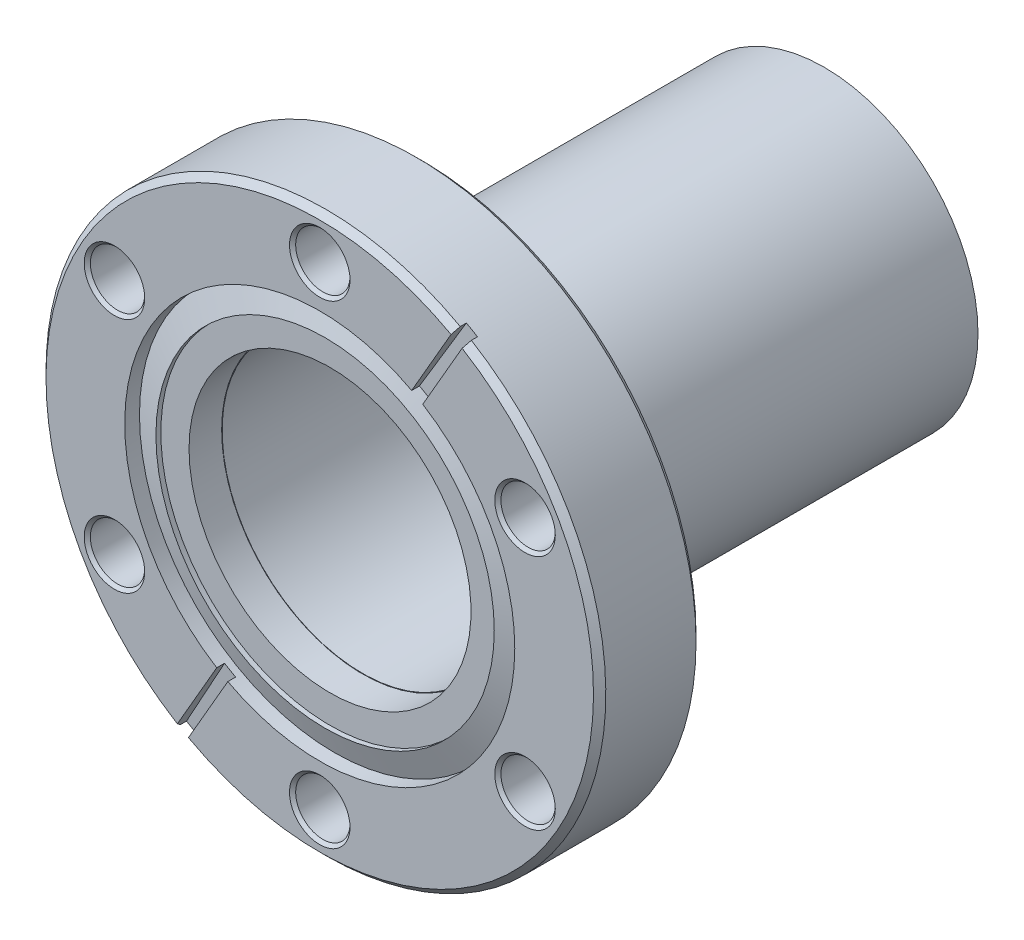
ISO-10303-21;
HEADER;
FILE_DESCRIPTION(('STEP AP214'),'2;1');
FILE_NAME('part.step','',(''),(''),'','','');
FILE_SCHEMA(('AUTOMOTIVE_DESIGN { 1 0 10303 214 1 1 1 1 }'));
ENDSEC;
DATA;
#1=APPLICATION_CONTEXT('core data for automotive mechanical design processes');
#2=APPLICATION_PROTOCOL_DEFINITION('international standard','automotive_design',2000,#1);
#3=PRODUCT_CONTEXT('',#1,'mechanical');
#4=PRODUCT('Part','Part','',(#3));
#5=PRODUCT_RELATED_PRODUCT_CATEGORY('part','',(#4));
#6=PRODUCT_DEFINITION_FORMATION('','',#4);
#7=PRODUCT_DEFINITION_CONTEXT('part definition',#1,'design');
#8=PRODUCT_DEFINITION('design','',#6,#7);
#9=PRODUCT_DEFINITION_SHAPE('','',#8);
#10=(LENGTH_UNIT() NAMED_UNIT(*) SI_UNIT(.MILLI.,.METRE.));
#11=(NAMED_UNIT(*) PLANE_ANGLE_UNIT() SI_UNIT($,.RADIAN.));
#12=(NAMED_UNIT(*) SI_UNIT($,.STERADIAN.) SOLID_ANGLE_UNIT());
#13=UNCERTAINTY_MEASURE_WITH_UNIT(LENGTH_MEASURE(1.E-05),#10,'distance_accuracy_value','');
#14=(GEOMETRIC_REPRESENTATION_CONTEXT(3) GLOBAL_UNCERTAINTY_ASSIGNED_CONTEXT((#13)) GLOBAL_UNIT_ASSIGNED_CONTEXT((#10,
#11,#12)) REPRESENTATION_CONTEXT('',''));
#15=CARTESIAN_POINT('',(0.,0.,0.));
#16=DIRECTION('',(0.,0.,1.));
#17=DIRECTION('',(1.,0.,0.));
#18=AXIS2_PLACEMENT_3D('',#15,#16,#17);
#19=CARTESIAN_POINT('',(0.,0.,-62.484));
#20=DIRECTION('',(0.,0.,1.));
#21=DIRECTION('',(1.,0.,0.));
#22=AXIS2_PLACEMENT_3D('',#19,#20,#21);
#23=CYLINDRICAL_SURFACE('',#22,17.399);
#24=CARTESIAN_POINT('',(0.,0.,-5.30859999999999));
#25=DIRECTION('',(0.,0.,1.));
#26=DIRECTION('',(1.,0.,0.));
#27=AXIS2_PLACEMENT_3D('',#24,#25,#26);
#28=CIRCLE('',#27,17.399);
#29=CARTESIAN_POINT('',(17.399,0.,-5.30859999999999));
#30=VERTEX_POINT('',#29);
#31=EDGE_CURVE('P0_E26',#30,#30,#28,.F.);
#32=ORIENTED_EDGE('',*,*,#31,.F.);
#33=EDGE_LOOP('',(#32));
#34=FACE_BOUND('',#33,.T.);
#35=CARTESIAN_POINT('',(0.,0.,-62.484));
#36=DIRECTION('',(0.,0.,1.));
#37=DIRECTION('',(1.,0.,0.));
#38=AXIS2_PLACEMENT_3D('',#35,#36,#37);
#39=CIRCLE('',#38,17.399);
#40=CARTESIAN_POINT('',(17.399,0.,-62.484));
#41=VERTEX_POINT('',#40);
#42=EDGE_CURVE('P0_E17',#41,#41,#39,.F.);
#43=ORIENTED_EDGE('',*,*,#42,.T.);
#44=EDGE_LOOP('',(#43));
#45=FACE_BOUND('',#44,.T.);
#46=ADVANCED_FACE('P0_F14',(#34,#45),#23,.F.);
#47=CARTESIAN_POINT('',(0.,0.,-62.484));
#48=DIRECTION('',(0.,0.,1.));
#49=DIRECTION('',(1.,0.,0.));
#50=AXIS2_PLACEMENT_3D('',#47,#48,#49);
#51=PLANE('',#50);
#52=CARTESIAN_POINT('',(0.,0.,-62.484));
#53=DIRECTION('',(0.,0.,1.));
#54=DIRECTION('',(1.,0.,0.));
#55=AXIS2_PLACEMENT_3D('',#52,#53,#54);
#56=CIRCLE('',#55,19.05);
#57=CARTESIAN_POINT('',(19.05,0.,-62.484));
#58=VERTEX_POINT('',#57);
#59=EDGE_CURVE('P0_E21',#58,#58,#56,.T.);
#60=ORIENTED_EDGE('',*,*,#59,.F.);
#61=EDGE_LOOP('',(#60));
#62=FACE_BOUND('',#61,.T.);
#63=ORIENTED_EDGE('',*,*,#42,.F.);
#64=EDGE_LOOP('',(#63));
#65=FACE_BOUND('',#64,.T.);
#66=ADVANCED_FACE('P0_F35',(#62,#65),#51,.F.);
#67=CARTESIAN_POINT('',(0.,0.,-5.30859999999999));
#68=DIRECTION('',(0.,0.,1.));
#69=DIRECTION('',(1.,0.,0.));
#70=AXIS2_PLACEMENT_3D('',#67,#68,#69);
#71=PLANE('',#70);
#72=CARTESIAN_POINT('',(0.,0.,-5.30859999999999));
#73=DIRECTION('',(0.,0.,1.));
#74=DIRECTION('',(1.,0.,0.));
#75=AXIS2_PLACEMENT_3D('',#72,#73,#74);
#76=CIRCLE('',#75,19.05);
#77=CARTESIAN_POINT('',(19.05,0.,-5.30859999999999));
#78=VERTEX_POINT('',#77);
#79=EDGE_CURVE('P0_E10',#78,#78,#76,.F.);
#80=ORIENTED_EDGE('',*,*,#79,.F.);
#81=EDGE_LOOP('',(#80));
#82=FACE_BOUND('',#81,.T.);
#83=ORIENTED_EDGE('',*,*,#31,.T.);
#84=EDGE_LOOP('',(#83));
#85=FACE_BOUND('',#84,.T.);
#86=ADVANCED_FACE('P0_F37',(#82,#85),#71,.T.);
#87=CARTESIAN_POINT('',(0.,0.,-62.484));
#88=DIRECTION('',(0.,0.,1.));
#89=DIRECTION('',(1.,0.,0.));
#90=AXIS2_PLACEMENT_3D('',#87,#88,#89);
#91=CYLINDRICAL_SURFACE('',#90,19.05);
#92=ORIENTED_EDGE('',*,*,#79,.T.);
#93=EDGE_LOOP('',(#92));
#94=FACE_BOUND('',#93,.T.);
#95=ORIENTED_EDGE('',*,*,#59,.T.);
#96=EDGE_LOOP('',(#95));
#97=FACE_BOUND('',#96,.T.);
#98=ADVANCED_FACE('P0_F44',(#94,#97),#91,.T.);
#99=CLOSED_SHELL('',(#46,#66,#86,#98));
#100=MANIFOLD_SOLID_BREP('P0_B1',#99);
#101=CARTESIAN_POINT('',(0.,0.,-1.91651285463287));
#102=DIRECTION('',(0.,0.,1.));
#103=DIRECTION('',(1.,0.,0.));
#104=AXIS2_PLACEMENT_3D('',#101,#102,#103);
#105=CYLINDRICAL_SURFACE('',#104,20.955);
#106=CARTESIAN_POINT('',(0.,0.,-0.660399999999616));
#107=DIRECTION('',(0.,0.,-1.));
#108=DIRECTION('',(-1.,0.,0.));
#109=AXIS2_PLACEMENT_3D('',#106,#107,#108);
#110=CIRCLE('',#109,20.9550000000001);
#111=CARTESIAN_POINT('',(-20.9550000000001,0.,-0.660399999999616));
#112=VERTEX_POINT('',#111);
#113=EDGE_CURVE('P1_E128',#112,#112,#110,.T.);
#114=ORIENTED_EDGE('',*,*,#113,.F.);
#115=EDGE_LOOP('',(#114));
#116=FACE_BOUND('',#115,.T.);
#117=CARTESIAN_POINT('',(0.,0.,-1.27));
#118=DIRECTION('',(0.,0.,1.));
#119=DIRECTION('',(1.,0.,0.));
#120=AXIS2_PLACEMENT_3D('',#117,#118,#119);
#121=CIRCLE('',#120,20.955);
#122=CARTESIAN_POINT('',(20.955,0.,-1.27));
#123=VERTEX_POINT('',#122);
#124=EDGE_CURVE('P1_E130',#123,#123,#121,.T.);
#125=ORIENTED_EDGE('',*,*,#124,.F.);
#126=EDGE_LOOP('',(#125));
#127=FACE_BOUND('',#126,.T.);
#128=ADVANCED_FACE('P1_F16',(#116,#127),#105,.F.);
#129=CARTESIAN_POINT('',(-11.1362923357452,-20.8761241334518,-0.9398));
#130=DIRECTION('',(-0.0261679781214693,-0.0453242676377388,0.998629534754574));
#131=DIRECTION('',(0.,-0.998971622769016,-0.0453397938045331));
#132=AXIS2_PLACEMENT_3D('',#129,#130,#131);
#133=PLANE('',#132);
#134=DIRECTION('',(-0.499314767377303,-0.864838546066886,-0.0523359562429542));
#135=VECTOR('',#134,1.);
#136=CARTESIAN_POINT('',(-11.3837698890914,-21.3047678295779,-0.965739497986353));
#137=LINE('',#136,#135);
#138=CARTESIAN_POINT('',(-11.3837698890905,-21.3047678295783,-0.965739497986395));
#139=VERTEX_POINT('',#138);
#140=CARTESIAN_POINT('',(-16.6435487572592,-30.4149720658212,-1.51704615798751));
#141=VERTEX_POINT('',#140);
#142=EDGE_CURVE('P1_E116',#139,#141,#137,.T.);
#143=ORIENTED_EDGE('',*,*,#142,.F.);
#144=CARTESIAN_POINT('',(0.,0.,0.299507719817694));
#145=DIRECTION('',(-0.0261679781214693,-0.0453242676377388,0.998629534754574));
#146=DIRECTION('',(0.499314767377261,0.864838546066911,0.0523359562429414));
#147=AXIS2_PLACEMENT_3D('',#144,#145,#146);
#148=ELLIPSE('',#147,24.1885495665182,24.1554);
#149=CARTESIAN_POINT('',(-12.758585217599,-20.5110178295779,-0.965739497986381));
#150=VERTEX_POINT('',#149);
#151=EDGE_CURVE('P1_E204',#139,#150,#148,.F.);
#152=ORIENTED_EDGE('',*,*,#151,.T.);
#153=DIRECTION('',(-0.499314767377303,-0.864838546066886,-0.0523359562429542));
#154=VECTOR('',#153,1.);
#155=CARTESIAN_POINT('',(-12.758585217599,-20.5110178295779,-0.965739497986328));
#156=LINE('',#155,#154);
#157=CARTESIAN_POINT('',(-18.0183640857669,-29.6212220658215,-1.5170461579875));
#158=VERTEX_POINT('',#157);
#159=EDGE_CURVE('P1_E113',#150,#158,#156,.T.);
#160=ORIENTED_EDGE('',*,*,#159,.T.);
#161=CARTESIAN_POINT('',(0.,0.,0.299507719817694));
#162=DIRECTION('',(-0.0261679781214693,-0.0453242676377388,0.998629534754574));
#163=DIRECTION('',(-0.499314767377261,-0.864838546066911,-0.0523359562429414));
#164=AXIS2_PLACEMENT_3D('',#161,#162,#163);
#165=ELLIPSE('',#164,34.7185806080939,34.671);
#166=EDGE_CURVE('P1_E19',#158,#141,#165,.T.);
#167=ORIENTED_EDGE('',*,*,#166,.T.);
#168=EDGE_LOOP('',(#143,#152,#160,#167));
#169=FACE_BOUND('',#168,.T.);
#170=ADVANCED_FACE('P1_F377',(#169),#133,.T.);
#171=CARTESIAN_POINT('',(12.5111076642548,20.0823741334518,-0.9398));
#172=DIRECTION('',(-0.0261679781214693,-0.0453242676377388,-0.998629534754574));
#173=DIRECTION('',(0.,0.998971622769016,-0.0453397938045331));
#174=AXIS2_PLACEMENT_3D('',#171,#172,#173);
#175=PLANE('',#174);
#176=DIRECTION('',(0.499314767377303,0.864838546066886,-0.0523359562429542));
#177=VECTOR('',#176,1.);
#178=CARTESIAN_POINT('',(12.758585217599,20.5110178295779,-0.965739497986305));
#179=LINE('',#178,#177);
#180=CARTESIAN_POINT('',(12.758585217599,20.511017829578,-0.965739497986347));
#181=VERTEX_POINT('',#180);
#182=CARTESIAN_POINT('',(18.0183640857669,29.6212220658215,-1.51704615798747));
#183=VERTEX_POINT('',#182);
#184=EDGE_CURVE('P1_E124',#181,#183,#179,.T.);
#185=ORIENTED_EDGE('',*,*,#184,.T.);
#186=CARTESIAN_POINT('',(0.,0.,0.299507719817739));
#187=DIRECTION('',(-0.0261679781214693,-0.0453242676377388,-0.998629534754574));
#188=DIRECTION('',(0.499314767377261,0.864838546066911,-0.0523359562429414));
#189=AXIS2_PLACEMENT_3D('',#186,#187,#188);
#190=ELLIPSE('',#189,34.7185806080939,34.671);
#191=CARTESIAN_POINT('',(16.6435487572592,30.4149720658212,-1.51704615798747));
#192=VERTEX_POINT('',#191);
#193=EDGE_CURVE('P1_E417',#192,#183,#190,.T.);
#194=ORIENTED_EDGE('',*,*,#193,.F.);
#195=DIRECTION('',(0.499314767377303,0.864838546066886,-0.0523359562429542));
#196=VECTOR('',#195,1.);
#197=CARTESIAN_POINT('',(11.3837698890914,21.3047678295779,-0.965739497986329));
#198=LINE('',#197,#196);
#199=CARTESIAN_POINT('',(11.3837698890905,21.3047678295783,-0.96573949798636));
#200=VERTEX_POINT('',#199);
#201=EDGE_CURVE('P1_E90',#200,#192,#198,.T.);
#202=ORIENTED_EDGE('',*,*,#201,.F.);
#203=CARTESIAN_POINT('',(0.,0.,0.299507719817739));
#204=DIRECTION('',(-0.0261679781214693,-0.0453242676377388,-0.998629534754574));
#205=DIRECTION('',(-0.499314767377261,-0.864838546066911,0.0523359562429414));
#206=AXIS2_PLACEMENT_3D('',#203,#204,#205);
#207=ELLIPSE('',#206,24.1885495665182,24.1554);
#208=EDGE_CURVE('P1_E131',#181,#200,#207,.F.);
#209=ORIENTED_EDGE('',*,*,#208,.F.);
#210=EDGE_LOOP('',(#185,#194,#202,#209));
#211=FACE_BOUND('',#210,.T.);
#212=ADVANCED_FACE('P1_F374',(#211),#175,.F.);
#213=CARTESIAN_POINT('',(0.,0.,-1.82525033774552));
#214=DIRECTION('',(0.,0.,-1.));
#215=DIRECTION('',(-1.,0.,0.));
#216=AXIS2_PLACEMENT_3D('',#213,#214,#215);
#217=CONICAL_SURFACE('',#216,24.1553999999988,1.2217304763958);
#218=CARTESIAN_POINT('',(0.,0.,-1.82525033774552));
#219=DIRECTION('',(0.,0.,1.));
#220=DIRECTION('',(1.,0.,0.));
#221=AXIS2_PLACEMENT_3D('',#218,#219,#220);
#222=CIRCLE('',#221,24.1554);
#223=CARTESIAN_POINT('',(24.1554,0.,-1.82525033774552));
#224=VERTEX_POINT('',#223);
#225=EDGE_CURVE('P1_E195',#224,#224,#222,.T.);
#226=ORIENTED_EDGE('',*,*,#225,.T.);
#227=EDGE_LOOP('',(#226));
#228=FACE_BOUND('',#227,.T.);
#229=ORIENTED_EDGE('',*,*,#113,.T.);
#230=EDGE_LOOP('',(#229));
#231=FACE_BOUND('',#230,.T.);
#232=ADVANCED_FACE('P1_F370',(#228,#231),#217,.T.);
#233=CARTESIAN_POINT('',(0.,0.,-1.27));
#234=DIRECTION('',(0.,0.,1.));
#235=DIRECTION('',(1.,0.,0.));
#236=AXIS2_PLACEMENT_3D('',#233,#234,#235);
#237=PLANE('',#236);
#238=ORIENTED_EDGE('',*,*,#124,.T.);
#239=EDGE_LOOP('',(#238));
#240=FACE_BOUND('',#239,.T.);
#241=CARTESIAN_POINT('',(0.,0.,-1.27));
#242=DIRECTION('',(0.,0.,-1.));
#243=DIRECTION('',(-1.,0.,0.));
#244=AXIS2_PLACEMENT_3D('',#241,#242,#243);
#245=CIRCLE('',#244,17.4625);
#246=CARTESIAN_POINT('',(-17.4625,0.,-1.27));
#247=VERTEX_POINT('',#246);
#248=EDGE_CURVE('P1_E193',#247,#247,#245,.T.);
#249=ORIENTED_EDGE('',*,*,#248,.T.);
#250=EDGE_LOOP('',(#249));
#251=FACE_BOUND('',#250,.T.);
#252=ADVANCED_FACE('P1_F366',(#240,#251),#237,.T.);
#253=CARTESIAN_POINT('',(0.687407664253804,-0.396875,0.));
#254=DIRECTION('',(-0.866025403784429,0.500000000000017,0.));
#255=DIRECTION('',(-0.500000000000017,-0.866025403784429,0.));
#256=AXIS2_PLACEMENT_3D('',#253,#254,#255);
#257=PLANE('',#256);
#258=ORIENTED_EDGE('',*,*,#142,.T.);
#259=DIRECTION('',(0.,0.,1.));
#260=VECTOR('',#259,1.);
#261=CARTESIAN_POINT('',(-16.6435487572588,-30.4149720658206,0.));
#262=LINE('',#261,#260);
#263=CARTESIAN_POINT('',(-16.6435487572585,-30.41497206582,-0.762000000000726));
#264=VERTEX_POINT('',#263);
#265=EDGE_CURVE('P1_E119',#141,#264,#262,.T.);
#266=ORIENTED_EDGE('',*,*,#265,.T.);
#267=DIRECTION('',(0.353600767689951,0.612454495234326,0.707012014294202));
#268=VECTOR('',#267,1.);
#269=CARTESIAN_POINT('',(-16.6435487572588,-30.4149720658206,-0.762000000001449));
#270=LINE('',#269,#268);
#271=CARTESIAN_POINT('',(-16.2624466266976,-29.754883812817,-2.02225389211996E-12));
#272=VERTEX_POINT('',#271);
#273=EDGE_CURVE('P1_E120',#264,#272,#270,.T.);
#274=ORIENTED_EDGE('',*,*,#273,.T.);
#275=DIRECTION('',(0.499999999999982,0.866025403784449,0.));
#276=VECTOR('',#275,1.);
#277=CARTESIAN_POINT('',(-16.2624466266971,-29.7548838128196,0.));
#278=LINE('',#277,#276);
#279=CARTESIAN_POINT('',(-11.3837698890897,-21.3047678295788,0.));
#280=VERTEX_POINT('',#279);
#281=EDGE_CURVE('P1_E192',#272,#280,#278,.T.);
#282=ORIENTED_EDGE('',*,*,#281,.T.);
#283=DIRECTION('',(0.,0.,1.));
#284=VECTOR('',#283,1.);
#285=CARTESIAN_POINT('',(-11.3837698890897,-21.3047678295788,-1.91651285463287));
#286=LINE('',#285,#284);
#287=EDGE_CURVE('P1_E123',#280,#139,#286,.F.);
#288=ORIENTED_EDGE('',*,*,#287,.T.);
#289=EDGE_LOOP('',(#258,#266,#274,#282,#288));
#290=FACE_BOUND('',#289,.T.);
#291=ADVANCED_FACE('P1_F363',(#290),#257,.T.);
#292=CARTESIAN_POINT('',(0.687407664253804,-0.396875,0.));
#293=DIRECTION('',(0.866025403784429,-0.500000000000017,0.));
#294=DIRECTION('',(0.500000000000017,0.866025403784429,0.));
#295=AXIS2_PLACEMENT_3D('',#292,#293,#294);
#296=PLANE('',#295);
#297=ORIENTED_EDGE('',*,*,#184,.F.);
#298=DIRECTION('',(0.,0.,1.));
#299=VECTOR('',#298,1.);
#300=CARTESIAN_POINT('',(12.7585852175989,20.511017829578,-1.91651285463287));
#301=LINE('',#300,#299);
#302=CARTESIAN_POINT('',(12.7585852175989,20.511017829578,0.));
#303=VERTEX_POINT('',#302);
#304=EDGE_CURVE('P1_E107',#181,#303,#301,.T.);
#305=ORIENTED_EDGE('',*,*,#304,.T.);
#306=DIRECTION('',(0.499999999999808,0.86602540378455,0.));
#307=VECTOR('',#306,1.);
#308=CARTESIAN_POINT('',(12.7585852175989,20.511017829578,0.));
#309=LINE('',#308,#307);
#310=CARTESIAN_POINT('',(17.6372619552034,28.9611338128152,-3.65481425399079E-12));
#311=VERTEX_POINT('',#310);
#312=EDGE_CURVE('P1_E191',#303,#311,#309,.T.);
#313=ORIENTED_EDGE('',*,*,#312,.T.);
#314=CARTESIAN_POINT('',(18.0183640857667,29.6212220658212,-0.76199999999924));
#315=CARTESIAN_POINT('',(17.9548472531624,29.5112076846145,-0.63499962158647));
#316=CARTESIAN_POINT('',(17.89133032598,29.4011931395939,-0.507999432380422));
#317=CARTESIAN_POINT('',(17.7642962824591,29.181163721925,-0.253999432381762));
#318=CARTESIAN_POINT('',(17.7007791661207,29.0711488492766,-0.126999621589151));
#319=CARTESIAN_POINT('',(17.6372619552043,28.9611338128143,-3.26244880993381E-12));
#320=B_SPLINE_CURVE_WITH_KNOTS('',3,(#314,#315,#316,#317,#318,#319),.UNSPECIFIED.,.F.,.F.,(4,2,
4),(0.,0.538887589315563,1.07777517863115),.UNSPECIFIED.);
#321=CARTESIAN_POINT('',(18.0183640857669,29.6212220658215,-0.761999999999121));
#322=VERTEX_POINT('',#321);
#323=EDGE_CURVE('P1_E127',#322,#311,#320,.T.);
#324=ORIENTED_EDGE('',*,*,#323,.F.);
#325=DIRECTION('',(0.,0.,1.));
#326=VECTOR('',#325,1.);
#327=CARTESIAN_POINT('',(18.0183640857667,29.6212220658211,0.));
#328=LINE('',#327,#326);
#329=EDGE_CURVE('P1_E121',#183,#322,#328,.T.);
#330=ORIENTED_EDGE('',*,*,#329,.F.);
#331=EDGE_LOOP('',(#297,#305,#313,#324,#330));
#332=FACE_BOUND('',#331,.T.);
#333=ADVANCED_FACE('P1_F264',(#332),#296,.F.);
#334=CARTESIAN_POINT('',(-0.687407664253804,0.396875,0.));
#335=DIRECTION('',(-0.866025403784429,0.500000000000017,0.));
#336=DIRECTION('',(-0.500000000000017,-0.866025403784429,0.));
#337=AXIS2_PLACEMENT_3D('',#334,#335,#336);
#338=PLANE('',#337);
#339=ORIENTED_EDGE('',*,*,#159,.F.);
#340=DIRECTION('',(0.,0.,1.));
#341=VECTOR('',#340,1.);
#342=CARTESIAN_POINT('',(-12.758585217599,-20.5110178295779,0.));
#343=LINE('',#342,#341);
#344=CARTESIAN_POINT('',(-12.7585852175989,-20.511017829578,0.));
#345=VERTEX_POINT('',#344);
#346=EDGE_CURVE('P1_E115',#345,#150,#343,.F.);
#347=ORIENTED_EDGE('',*,*,#346,.F.);
#348=DIRECTION('',(-0.499999999999808,-0.86602540378455,0.));
#349=VECTOR('',#348,1.);
#350=CARTESIAN_POINT('',(-12.7585852175989,-20.511017829578,0.));
#351=LINE('',#350,#349);
#352=CARTESIAN_POINT('',(-17.6372619552034,-28.9611338128152,-3.655862626358E-12));
#353=VERTEX_POINT('',#352);
#354=EDGE_CURVE('P1_E401',#345,#353,#351,.T.);
#355=ORIENTED_EDGE('',*,*,#354,.T.);
#356=CARTESIAN_POINT('',(-18.0183640857667,-29.6212220658212,-0.761999999999239));
#357=CARTESIAN_POINT('',(-17.9548472531624,-29.5112076846145,-0.634999621586467));
#358=CARTESIAN_POINT('',(-17.89133032598,-29.4011931395939,-0.507999432380417));
#359=CARTESIAN_POINT('',(-17.7642962824591,-29.181163721925,-0.25399943238176));
#360=CARTESIAN_POINT('',(-17.7007791661207,-29.0711488492766,-0.126999621589151));
#361=CARTESIAN_POINT('',(-17.6372619552043,-28.9611338128143,-3.26550479520607E-12));
#362=B_SPLINE_CURVE_WITH_KNOTS('',3,(#356,#357,#358,#359,#360,#361),.UNSPECIFIED.,.F.,.F.,(4,2,
4),(0.,0.538887589315564,1.07777517863115),.UNSPECIFIED.);
#363=CARTESIAN_POINT('',(-18.0183640857669,-29.6212220658215,-0.761999999999119));
#364=VERTEX_POINT('',#363);
#365=EDGE_CURVE('P1_E197',#364,#353,#362,.T.);
#366=ORIENTED_EDGE('',*,*,#365,.F.);
#367=DIRECTION('',(0.,0.,1.));
#368=VECTOR('',#367,1.);
#369=CARTESIAN_POINT('',(-18.0183640857667,-29.6212220658211,0.));
#370=LINE('',#369,#368);
#371=EDGE_CURVE('P1_E91',#158,#364,#370,.T.);
#372=ORIENTED_EDGE('',*,*,#371,.F.);
#373=EDGE_LOOP('',(#339,#347,#355,#366,#372));
#374=FACE_BOUND('',#373,.T.);
#375=ADVANCED_FACE('P1_F206',(#374),#338,.F.);
#376=CARTESIAN_POINT('',(-0.687407664253804,0.396875,0.));
#377=DIRECTION('',(0.866025403784429,-0.500000000000017,0.));
#378=DIRECTION('',(0.500000000000017,0.866025403784429,0.));
#379=AXIS2_PLACEMENT_3D('',#376,#377,#378);
#380=PLANE('',#379);
#381=ORIENTED_EDGE('',*,*,#201,.T.);
#382=DIRECTION('',(0.,0.,1.));
#383=VECTOR('',#382,1.);
#384=CARTESIAN_POINT('',(16.6435487572588,30.4149720658206,0.));
#385=LINE('',#384,#383);
#386=CARTESIAN_POINT('',(16.6435487572585,30.41497206582,-0.762000000000723));
#387=VERTEX_POINT('',#386);
#388=EDGE_CURVE('P1_E95',#192,#387,#385,.T.);
#389=ORIENTED_EDGE('',*,*,#388,.T.);
#390=DIRECTION('',(-0.353600767689952,-0.612454495234327,0.7070120142942));
#391=VECTOR('',#390,1.);
#392=CARTESIAN_POINT('',(16.6435487572588,30.4149720658206,-0.762000000001445));
#393=LINE('',#392,#391);
#394=CARTESIAN_POINT('',(16.2624466266976,29.754883812817,-2.00523191801194E-12));
#395=VERTEX_POINT('',#394);
#396=EDGE_CURVE('P1_E34',#387,#395,#393,.T.);
#397=ORIENTED_EDGE('',*,*,#396,.T.);
#398=DIRECTION('',(-0.499999999999982,-0.866025403784449,0.));
#399=VECTOR('',#398,1.);
#400=CARTESIAN_POINT('',(16.2624466266971,29.7548838128196,0.));
#401=LINE('',#400,#399);
#402=CARTESIAN_POINT('',(11.3837698890897,21.3047678295788,0.));
#403=VERTEX_POINT('',#402);
#404=EDGE_CURVE('P1_E187',#395,#403,#401,.T.);
#405=ORIENTED_EDGE('',*,*,#404,.T.);
#406=DIRECTION('',(0.,0.,1.));
#407=VECTOR('',#406,1.);
#408=CARTESIAN_POINT('',(11.3837698890897,21.3047678295788,-1.91651285463287));
#409=LINE('',#408,#407);
#410=EDGE_CURVE('P1_E105',#403,#200,#409,.F.);
#411=ORIENTED_EDGE('',*,*,#410,.T.);
#412=EDGE_LOOP('',(#381,#389,#397,#405,#411));
#413=FACE_BOUND('',#412,.T.);
#414=ADVANCED_FACE('P1_F102',(#413),#380,.T.);
#415=CARTESIAN_POINT('',(0.,0.,-1.91651285463287));
#416=DIRECTION('',(0.,0.,1.));
#417=DIRECTION('',(1.,0.,0.));
#418=AXIS2_PLACEMENT_3D('',#415,#416,#417);
#419=CYLINDRICAL_SURFACE('',#418,24.1554);
#420=ORIENTED_EDGE('',*,*,#225,.F.);
#421=EDGE_LOOP('',(#420));
#422=FACE_BOUND('',#421,.T.);
#423=ORIENTED_EDGE('',*,*,#287,.F.);
#424=CARTESIAN_POINT('',(0.,0.,0.));
#425=DIRECTION('',(0.,0.,1.));
#426=DIRECTION('',(1.,0.,0.));
#427=AXIS2_PLACEMENT_3D('',#424,#425,#426);
#428=CIRCLE('',#427,24.1554);
#429=EDGE_CURVE('P1_E188',#280,#303,#428,.T.);
#430=ORIENTED_EDGE('',*,*,#429,.T.);
#431=ORIENTED_EDGE('',*,*,#304,.F.);
#432=ORIENTED_EDGE('',*,*,#208,.T.);
#433=ORIENTED_EDGE('',*,*,#410,.F.);
#434=CARTESIAN_POINT('',(0.,0.,0.));
#435=DIRECTION('',(0.,0.,1.));
#436=DIRECTION('',(1.,0.,0.));
#437=AXIS2_PLACEMENT_3D('',#434,#435,#436);
#438=CIRCLE('',#437,24.1554);
#439=EDGE_CURVE('P1_E184',#403,#345,#438,.T.);
#440=ORIENTED_EDGE('',*,*,#439,.T.);
#441=ORIENTED_EDGE('',*,*,#346,.T.);
#442=ORIENTED_EDGE('',*,*,#151,.F.);
#443=EDGE_LOOP('',(#423,#430,#431,#432,#433,#440,#441,#442));
#444=FACE_BOUND('',#443,.T.);
#445=ADVANCED_FACE('P1_F255',(#422,#444),#419,.F.);
#446=CARTESIAN_POINT('',(0.,0.,-1.27));
#447=DIRECTION('',(0.,0.,-1.));
#448=DIRECTION('',(-1.,0.,0.));
#449=AXIS2_PLACEMENT_3D('',#446,#447,#448);
#450=CYLINDRICAL_SURFACE('',#449,17.4625);
#451=ORIENTED_EDGE('',*,*,#248,.F.);
#452=EDGE_LOOP('',(#451));
#453=FACE_BOUND('',#452,.T.);
#454=CARTESIAN_POINT('',(0.,0.,-5.3086));
#455=DIRECTION('',(0.,0.,-1.));
#456=DIRECTION('',(-1.,0.,0.));
#457=AXIS2_PLACEMENT_3D('',#454,#455,#456);
#458=CIRCLE('',#457,17.4625);
#459=CARTESIAN_POINT('',(-17.4625,0.,-5.3086));
#460=VERTEX_POINT('',#459);
#461=EDGE_CURVE('P1_E163',#460,#460,#458,.T.);
#462=ORIENTED_EDGE('',*,*,#461,.T.);
#463=EDGE_LOOP('',(#462));
#464=FACE_BOUND('',#463,.T.);
#465=ADVANCED_FACE('P1_F251',(#453,#464),#450,.F.);
#466=CARTESIAN_POINT('',(0.,0.,0.));
#467=DIRECTION('',(0.,0.,-1.));
#468=DIRECTION('',(-1.,0.,0.));
#469=AXIS2_PLACEMENT_3D('',#466,#467,#468);
#470=PLANE('',#469);
#471=ORIENTED_EDGE('',*,*,#429,.F.);
#472=ORIENTED_EDGE('',*,*,#281,.F.);
#473=CARTESIAN_POINT('',(0.,0.,-4.04439936402268E-12));
#474=DIRECTION('',(0.,0.,-1.));
#475=DIRECTION('',(-1.,0.,0.));
#476=AXIS2_PLACEMENT_3D('',#473,#474,#475);
#477=CIRCLE('',#476,33.9090000000042);
#478=EDGE_CURVE('P1_E160',#311,#272,#477,.T.);
#479=ORIENTED_EDGE('',*,*,#478,.F.);
#480=ORIENTED_EDGE('',*,*,#312,.F.);
#481=EDGE_LOOP('',(#471,#472,#479,#480));
#482=FACE_BOUND('',#481,.T.);
#483=CARTESIAN_POINT('',(25.428584316085,14.6812,0.));
#484=DIRECTION('',(0.,0.,1.));
#485=DIRECTION('',(1.,0.,0.));
#486=AXIS2_PLACEMENT_3D('',#483,#484,#485);
#487=CIRCLE('',#486,3.74650000010853);
#488=CARTESIAN_POINT('',(29.1750843161935,14.6812,0.));
#489=VERTEX_POINT('',#488);
#490=EDGE_CURVE('P1_E169',#489,#489,#487,.F.);
#491=ORIENTED_EDGE('',*,*,#490,.T.);
#492=EDGE_LOOP('',(#491));
#493=FACE_BOUND('',#492,.T.);
#494=CARTESIAN_POINT('',(25.428584316085,-14.6812,0.));
#495=DIRECTION('',(0.,0.,1.));
#496=DIRECTION('',(1.,0.,0.));
#497=AXIS2_PLACEMENT_3D('',#494,#495,#496);
#498=CIRCLE('',#497,3.74650000010853);
#499=CARTESIAN_POINT('',(29.1750843161935,-14.6812,0.));
#500=VERTEX_POINT('',#499);
#501=EDGE_CURVE('P1_E172',#500,#500,#498,.F.);
#502=ORIENTED_EDGE('',*,*,#501,.T.);
#503=EDGE_LOOP('',(#502));
#504=FACE_BOUND('',#503,.T.);
#505=CARTESIAN_POINT('',(0.,-29.3624,-5.6843418860808E-11));
#506=DIRECTION('',(0.,0.,1.));
#507=DIRECTION('',(1.,0.,0.));
#508=AXIS2_PLACEMENT_3D('',#505,#506,#507);
#509=CIRCLE('',#508,3.746499999977);
#510=CARTESIAN_POINT('',(3.746499999977,-29.3624,-5.6843418860808E-11));
#511=VERTEX_POINT('',#510);
#512=EDGE_CURVE('P1_E175',#511,#511,#509,.F.);
#513=ORIENTED_EDGE('',*,*,#512,.T.);
#514=EDGE_LOOP('',(#513));
#515=FACE_BOUND('',#514,.T.);
#516=ADVANCED_FACE('P1_F247',(#482,#493,#504,#515),#470,.F.);
#517=CARTESIAN_POINT('',(0.,0.,0.));
#518=DIRECTION('',(0.,0.,-1.));
#519=DIRECTION('',(-1.,0.,0.));
#520=AXIS2_PLACEMENT_3D('',#517,#518,#519);
#521=PLANE('',#520);
#522=ORIENTED_EDGE('',*,*,#404,.F.);
#523=CARTESIAN_POINT('',(0.,0.,-4.01057225624113E-12));
#524=DIRECTION('',(0.,0.,-1.));
#525=DIRECTION('',(-1.,0.,0.));
#526=AXIS2_PLACEMENT_3D('',#523,#524,#525);
#527=CIRCLE('',#526,33.9090000000041);
#528=EDGE_CURVE('P1_E89',#353,#395,#527,.T.);
#529=ORIENTED_EDGE('',*,*,#528,.F.);
#530=ORIENTED_EDGE('',*,*,#354,.F.);
#531=ORIENTED_EDGE('',*,*,#439,.F.);
#532=EDGE_LOOP('',(#522,#529,#530,#531));
#533=FACE_BOUND('',#532,.T.);
#534=CARTESIAN_POINT('',(0.,29.3624,-5.6843418860808E-11));
#535=DIRECTION('',(0.,0.,1.));
#536=DIRECTION('',(1.,0.,0.));
#537=AXIS2_PLACEMENT_3D('',#534,#535,#536);
#538=CIRCLE('',#537,3.746499999977);
#539=CARTESIAN_POINT('',(3.746499999977,29.3624,-5.6843418860808E-11));
#540=VERTEX_POINT('',#539);
#541=EDGE_CURVE('P1_E166',#540,#540,#538,.F.);
#542=ORIENTED_EDGE('',*,*,#541,.T.);
#543=EDGE_LOOP('',(#542));
#544=FACE_BOUND('',#543,.T.);
#545=CARTESIAN_POINT('',(-25.428584316085,-14.6812,5.6843418860808E-11));
#546=DIRECTION('',(0.,0.,1.));
#547=DIRECTION('',(1.,0.,0.));
#548=AXIS2_PLACEMENT_3D('',#545,#546,#547);
#549=CIRCLE('',#548,3.74649999995916);
#550=CARTESIAN_POINT('',(-21.6820843161258,-14.6812,5.6843418860808E-11));
#551=VERTEX_POINT('',#550);
#552=EDGE_CURVE('P1_E178',#551,#551,#549,.F.);
#553=ORIENTED_EDGE('',*,*,#552,.T.);
#554=EDGE_LOOP('',(#553));
#555=FACE_BOUND('',#554,.T.);
#556=CARTESIAN_POINT('',(-25.428584316085,14.6812,5.6843418860808E-11));
#557=DIRECTION('',(0.,0.,1.));
#558=DIRECTION('',(1.,0.,0.));
#559=AXIS2_PLACEMENT_3D('',#556,#557,#558);
#560=CIRCLE('',#559,3.74649999995916);
#561=CARTESIAN_POINT('',(-21.6820843161258,14.6812,5.6843418860808E-11));
#562=VERTEX_POINT('',#561);
#563=EDGE_CURVE('P1_E181',#562,#562,#560,.F.);
#564=ORIENTED_EDGE('',*,*,#563,.T.);
#565=EDGE_LOOP('',(#564));
#566=FACE_BOUND('',#565,.T.);
#567=ADVANCED_FACE('P1_F243',(#533,#544,#555,#566),#521,.F.);
#568=CARTESIAN_POINT('',(-25.428584316085,14.6812,5.6843418860808E-11));
#569=DIRECTION('',(0.,0.,1.));
#570=DIRECTION('',(1.,0.,0.));
#571=AXIS2_PLACEMENT_3D('',#568,#569,#570);
#572=CONICAL_SURFACE('',#571,3.74649999995916,0.785398163397448);
#573=CARTESIAN_POINT('',(-25.428584316085,14.6812,-0.381));
#574=DIRECTION('',(0.,0.,-1.));
#575=DIRECTION('',(-1.,0.,0.));
#576=AXIS2_PLACEMENT_3D('',#573,#574,#575);
#577=CIRCLE('',#576,3.3655);
#578=CARTESIAN_POINT('',(-28.794084316085,14.6812,-0.381));
#579=VERTEX_POINT('',#578);
#580=EDGE_CURVE('P1_E159',#579,#579,#577,.T.);
#581=ORIENTED_EDGE('',*,*,#580,.T.);
#582=EDGE_LOOP('',(#581));
#583=FACE_BOUND('',#582,.T.);
#584=ORIENTED_EDGE('',*,*,#563,.F.);
#585=EDGE_LOOP('',(#584));
#586=FACE_BOUND('',#585,.T.);
#587=ADVANCED_FACE('P1_F239',(#583,#586),#572,.F.);
#588=CARTESIAN_POINT('',(-25.428584316085,-14.6812,5.6843418860808E-11));
#589=DIRECTION('',(0.,0.,1.));
#590=DIRECTION('',(1.,0.,0.));
#591=AXIS2_PLACEMENT_3D('',#588,#589,#590);
#592=CONICAL_SURFACE('',#591,3.74649999995916,0.785398163397448);
#593=CARTESIAN_POINT('',(-25.428584316085,-14.6812,-0.381));
#594=DIRECTION('',(0.,0.,-1.));
#595=DIRECTION('',(-1.,0.,0.));
#596=AXIS2_PLACEMENT_3D('',#593,#594,#595);
#597=CIRCLE('',#596,3.3655);
#598=CARTESIAN_POINT('',(-28.794084316085,-14.6812,-0.381));
#599=VERTEX_POINT('',#598);
#600=EDGE_CURVE('P1_E449',#599,#599,#597,.T.);
#601=ORIENTED_EDGE('',*,*,#600,.T.);
#602=EDGE_LOOP('',(#601));
#603=FACE_BOUND('',#602,.T.);
#604=ORIENTED_EDGE('',*,*,#552,.F.);
#605=EDGE_LOOP('',(#604));
#606=FACE_BOUND('',#605,.T.);
#607=ADVANCED_FACE('P1_F235',(#603,#606),#592,.F.);
#608=CARTESIAN_POINT('',(0.,-29.3624,-5.6843418860808E-11));
#609=DIRECTION('',(0.,0.,1.));
#610=DIRECTION('',(1.,0.,0.));
#611=AXIS2_PLACEMENT_3D('',#608,#609,#610);
#612=CONICAL_SURFACE('',#611,3.746499999977,0.785398163472046);
#613=CARTESIAN_POINT('',(0.,-29.3624,-0.381));
#614=DIRECTION('',(0.,0.,-1.));
#615=DIRECTION('',(-1.,0.,0.));
#616=AXIS2_PLACEMENT_3D('',#613,#614,#615);
#617=CIRCLE('',#616,3.3655);
#618=CARTESIAN_POINT('',(-3.3655,-29.3624,-0.381));
#619=VERTEX_POINT('',#618);
#620=EDGE_CURVE('P1_E452',#619,#619,#617,.T.);
#621=ORIENTED_EDGE('',*,*,#620,.T.);
#622=EDGE_LOOP('',(#621));
#623=FACE_BOUND('',#622,.T.);
#624=ORIENTED_EDGE('',*,*,#512,.F.);
#625=EDGE_LOOP('',(#624));
#626=FACE_BOUND('',#625,.T.);
#627=ADVANCED_FACE('P1_F231',(#623,#626),#612,.F.);
#628=CARTESIAN_POINT('',(25.428584316085,-14.6812,0.));
#629=DIRECTION('',(0.,0.,1.));
#630=DIRECTION('',(1.,0.,0.));
#631=AXIS2_PLACEMENT_3D('',#628,#629,#630);
#632=CONICAL_SURFACE('',#631,3.74650000010853,0.785398163397448);
#633=CARTESIAN_POINT('',(25.428584316085,-14.6812,-0.381));
#634=DIRECTION('',(0.,0.,-1.));
#635=DIRECTION('',(-1.,0.,0.));
#636=AXIS2_PLACEMENT_3D('',#633,#634,#635);
#637=CIRCLE('',#636,3.3655);
#638=CARTESIAN_POINT('',(22.063084316085,-14.6812,-0.381));
#639=VERTEX_POINT('',#638);
#640=EDGE_CURVE('P1_E455',#639,#639,#637,.T.);
#641=ORIENTED_EDGE('',*,*,#640,.T.);
#642=EDGE_LOOP('',(#641));
#643=FACE_BOUND('',#642,.T.);
#644=ORIENTED_EDGE('',*,*,#501,.F.);
#645=EDGE_LOOP('',(#644));
#646=FACE_BOUND('',#645,.T.);
#647=ADVANCED_FACE('P1_F227',(#643,#646),#632,.F.);
#648=CARTESIAN_POINT('',(25.428584316085,14.6812,0.));
#649=DIRECTION('',(0.,0.,1.));
#650=DIRECTION('',(1.,0.,0.));
#651=AXIS2_PLACEMENT_3D('',#648,#649,#650);
#652=CONICAL_SURFACE('',#651,3.74650000010853,0.785398163397448);
#653=CARTESIAN_POINT('',(25.428584316085,14.6812,-0.381));
#654=DIRECTION('',(0.,0.,-1.));
#655=DIRECTION('',(-1.,0.,0.));
#656=AXIS2_PLACEMENT_3D('',#653,#654,#655);
#657=CIRCLE('',#656,3.3655);
#658=CARTESIAN_POINT('',(22.063084316085,14.6812,-0.381));
#659=VERTEX_POINT('',#658);
#660=EDGE_CURVE('P1_E458',#659,#659,#657,.T.);
#661=ORIENTED_EDGE('',*,*,#660,.T.);
#662=EDGE_LOOP('',(#661));
#663=FACE_BOUND('',#662,.T.);
#664=ORIENTED_EDGE('',*,*,#490,.F.);
#665=EDGE_LOOP('',(#664));
#666=FACE_BOUND('',#665,.T.);
#667=ADVANCED_FACE('P1_F223',(#663,#666),#652,.F.);
#668=CARTESIAN_POINT('',(0.,29.3624,-5.6843418860808E-11));
#669=DIRECTION('',(0.,0.,1.));
#670=DIRECTION('',(1.,0.,0.));
#671=AXIS2_PLACEMENT_3D('',#668,#669,#670);
#672=CONICAL_SURFACE('',#671,3.746499999977,0.785398163472046);
#673=CARTESIAN_POINT('',(0.,29.3624,-0.381));
#674=DIRECTION('',(0.,0.,-1.));
#675=DIRECTION('',(-1.,0.,0.));
#676=AXIS2_PLACEMENT_3D('',#673,#674,#675);
#677=CIRCLE('',#676,3.3655);
#678=CARTESIAN_POINT('',(-3.3655,29.3624,-0.381));
#679=VERTEX_POINT('',#678);
#680=EDGE_CURVE('P1_E157',#679,#679,#677,.T.);
#681=ORIENTED_EDGE('',*,*,#680,.T.);
#682=EDGE_LOOP('',(#681));
#683=FACE_BOUND('',#682,.T.);
#684=ORIENTED_EDGE('',*,*,#541,.F.);
#685=EDGE_LOOP('',(#684));
#686=FACE_BOUND('',#685,.T.);
#687=ADVANCED_FACE('P1_F219',(#683,#686),#672,.F.);
#688=CARTESIAN_POINT('',(0.,0.,-5.3086));
#689=DIRECTION('',(0.,0.,1.));
#690=DIRECTION('',(1.,0.,0.));
#691=AXIS2_PLACEMENT_3D('',#688,#689,#690);
#692=PLANE('',#691);
#693=CARTESIAN_POINT('',(0.,0.,-5.3086));
#694=DIRECTION('',(0.,0.,1.));
#695=DIRECTION('',(1.,0.,0.));
#696=AXIS2_PLACEMENT_3D('',#693,#694,#695);
#697=CIRCLE('',#696,19.177);
#698=CARTESIAN_POINT('',(19.177,0.,-5.3086));
#699=VERTEX_POINT('',#698);
#700=EDGE_CURVE('P1_E154',#699,#699,#697,.F.);
#701=ORIENTED_EDGE('',*,*,#700,.T.);
#702=EDGE_LOOP('',(#701));
#703=FACE_BOUND('',#702,.T.);
#704=ORIENTED_EDGE('',*,*,#461,.F.);
#705=EDGE_LOOP('',(#704));
#706=FACE_BOUND('',#705,.T.);
#707=ADVANCED_FACE('P1_F216',(#703,#706),#692,.F.);
#708=CARTESIAN_POINT('',(0.,0.,-0.762000000000058));
#709=DIRECTION('',(0.,0.,-1.));
#710=DIRECTION('',(-1.,0.,0.));
#711=AXIS2_PLACEMENT_3D('',#708,#709,#710);
#712=CONICAL_SURFACE('',#711,34.6709999999999,0.785398163397299);
#713=CARTESIAN_POINT('',(0.,0.,-0.761999999999097));
#714=DIRECTION('',(0.,0.,-1.));
#715=DIRECTION('',(-1.,0.,0.));
#716=AXIS2_PLACEMENT_3D('',#713,#714,#715);
#717=CIRCLE('',#716,34.671);
#718=EDGE_CURVE('P1_E100',#322,#264,#717,.T.);
#719=ORIENTED_EDGE('',*,*,#718,.F.);
#720=ORIENTED_EDGE('',*,*,#323,.T.);
#721=ORIENTED_EDGE('',*,*,#478,.T.);
#722=ORIENTED_EDGE('',*,*,#273,.F.);
#723=EDGE_LOOP('',(#719,#720,#721,#722));
#724=FACE_BOUND('',#723,.T.);
#725=ADVANCED_FACE('P1_F213',(#724),#712,.T.);
#726=CARTESIAN_POINT('',(0.,0.,-0.76199999999862));
#727=DIRECTION('',(0.,0.,-1.));
#728=DIRECTION('',(-1.,0.,0.));
#729=AXIS2_PLACEMENT_3D('',#726,#727,#728);
#730=CONICAL_SURFACE('',#729,34.6709999999985,0.7853981633973);
#731=ORIENTED_EDGE('',*,*,#396,.F.);
#732=CARTESIAN_POINT('',(0.,0.,-0.762));
#733=DIRECTION('',(0.,0.,-1.));
#734=DIRECTION('',(-1.,0.,0.));
#735=AXIS2_PLACEMENT_3D('',#732,#733,#734);
#736=CIRCLE('',#735,34.671);
#737=EDGE_CURVE('P1_E88',#364,#387,#736,.T.);
#738=ORIENTED_EDGE('',*,*,#737,.F.);
#739=ORIENTED_EDGE('',*,*,#365,.T.);
#740=ORIENTED_EDGE('',*,*,#528,.T.);
#741=EDGE_LOOP('',(#731,#738,#739,#740));
#742=FACE_BOUND('',#741,.T.);
#743=ADVANCED_FACE('P1_F86',(#742),#730,.T.);
#744=CARTESIAN_POINT('',(-25.428584316085,14.6812,0.));
#745=DIRECTION('',(0.,0.,-1.));
#746=DIRECTION('',(-1.,0.,0.));
#747=AXIS2_PLACEMENT_3D('',#744,#745,#746);
#748=CYLINDRICAL_SURFACE('',#747,3.3655);
#749=ORIENTED_EDGE('',*,*,#580,.F.);
#750=EDGE_LOOP('',(#749));
#751=FACE_BOUND('',#750,.T.);
#752=CARTESIAN_POINT('',(-25.428584316085,14.6812,-12.3189999998772));
#753=DIRECTION('',(0.,0.,-1.));
#754=DIRECTION('',(-1.,0.,0.));
#755=AXIS2_PLACEMENT_3D('',#752,#753,#754);
#756=CIRCLE('',#755,3.3654999999336);
#757=CARTESIAN_POINT('',(-28.7940843160186,14.6812,-12.3189999998772));
#758=VERTEX_POINT('',#757);
#759=EDGE_CURVE('P1_E99',#758,#758,#756,.T.);
#760=ORIENTED_EDGE('',*,*,#759,.T.);
#761=EDGE_LOOP('',(#760));
#762=FACE_BOUND('',#761,.T.);
#763=ADVANCED_FACE('P1_F332',(#751,#762),#748,.F.);
#764=CARTESIAN_POINT('',(-25.428584316085,-14.6812,0.));
#765=DIRECTION('',(0.,0.,-1.));
#766=DIRECTION('',(-1.,0.,0.));
#767=AXIS2_PLACEMENT_3D('',#764,#765,#766);
#768=CYLINDRICAL_SURFACE('',#767,3.3655);
#769=ORIENTED_EDGE('',*,*,#600,.F.);
#770=EDGE_LOOP('',(#769));
#771=FACE_BOUND('',#770,.T.);
#772=CARTESIAN_POINT('',(-25.428584316085,-14.6812,-12.3189999998772));
#773=DIRECTION('',(0.,0.,-1.));
#774=DIRECTION('',(-1.,0.,0.));
#775=AXIS2_PLACEMENT_3D('',#772,#773,#774);
#776=CIRCLE('',#775,3.3654999999336);
#777=CARTESIAN_POINT('',(-28.7940843160186,-14.6812,-12.3189999998772));
#778=VERTEX_POINT('',#777);
#779=EDGE_CURVE('P1_E469',#778,#778,#776,.T.);
#780=ORIENTED_EDGE('',*,*,#779,.T.);
#781=EDGE_LOOP('',(#780));
#782=FACE_BOUND('',#781,.T.);
#783=ADVANCED_FACE('P1_F328',(#771,#782),#768,.F.);
#784=CARTESIAN_POINT('',(0.,-29.3624,0.));
#785=DIRECTION('',(0.,0.,-1.));
#786=DIRECTION('',(-1.,0.,0.));
#787=AXIS2_PLACEMENT_3D('',#784,#785,#786);
#788=CYLINDRICAL_SURFACE('',#787,3.3655);
#789=ORIENTED_EDGE('',*,*,#620,.F.);
#790=EDGE_LOOP('',(#789));
#791=FACE_BOUND('',#790,.T.);
#792=CARTESIAN_POINT('',(0.,-29.3624,-12.3190000000477));
#793=DIRECTION('',(0.,0.,-1.));
#794=DIRECTION('',(-1.,0.,0.));
#795=AXIS2_PLACEMENT_3D('',#792,#793,#794);
#796=CIRCLE('',#795,3.36550000002944);
#797=CARTESIAN_POINT('',(-3.36550000002944,-29.3624,-12.3190000000477));
#798=VERTEX_POINT('',#797);
#799=EDGE_CURVE('P1_E472',#798,#798,#796,.T.);
#800=ORIENTED_EDGE('',*,*,#799,.T.);
#801=EDGE_LOOP('',(#800));
#802=FACE_BOUND('',#801,.T.);
#803=ADVANCED_FACE('P1_F324',(#791,#802),#788,.F.);
#804=CARTESIAN_POINT('',(25.428584316085,-14.6812,0.));
#805=DIRECTION('',(0.,0.,-1.));
#806=DIRECTION('',(-1.,0.,0.));
#807=AXIS2_PLACEMENT_3D('',#804,#805,#806);
#808=CYLINDRICAL_SURFACE('',#807,3.3655);
#809=ORIENTED_EDGE('',*,*,#640,.F.);
#810=EDGE_LOOP('',(#809));
#811=FACE_BOUND('',#810,.T.);
#812=CARTESIAN_POINT('',(25.428584316085,-14.6812,-12.3190000000477));
#813=DIRECTION('',(0.,0.,-1.));
#814=DIRECTION('',(-1.,0.,0.));
#815=AXIS2_PLACEMENT_3D('',#812,#813,#814);
#816=CIRCLE('',#815,3.3655000000116);
#817=CARTESIAN_POINT('',(22.0630843160734,-14.6812,-12.3190000000477));
#818=VERTEX_POINT('',#817);
#819=EDGE_CURVE('P1_E475',#818,#818,#816,.T.);
#820=ORIENTED_EDGE('',*,*,#819,.T.);
#821=EDGE_LOOP('',(#820));
#822=FACE_BOUND('',#821,.T.);
#823=ADVANCED_FACE('P1_F320',(#811,#822),#808,.F.);
#824=CARTESIAN_POINT('',(25.428584316085,14.6812,0.));
#825=DIRECTION('',(0.,0.,-1.));
#826=DIRECTION('',(-1.,0.,0.));
#827=AXIS2_PLACEMENT_3D('',#824,#825,#826);
#828=CYLINDRICAL_SURFACE('',#827,3.3655);
#829=ORIENTED_EDGE('',*,*,#660,.F.);
#830=EDGE_LOOP('',(#829));
#831=FACE_BOUND('',#830,.T.);
#832=CARTESIAN_POINT('',(25.428584316085,14.6812,-12.3190000000477));
#833=DIRECTION('',(0.,0.,-1.));
#834=DIRECTION('',(-1.,0.,0.));
#835=AXIS2_PLACEMENT_3D('',#832,#833,#834);
#836=CIRCLE('',#835,3.3655000000116);
#837=CARTESIAN_POINT('',(22.0630843160734,14.6812,-12.3190000000477));
#838=VERTEX_POINT('',#837);
#839=EDGE_CURVE('P1_E478',#838,#838,#836,.T.);
#840=ORIENTED_EDGE('',*,*,#839,.T.);
#841=EDGE_LOOP('',(#840));
#842=FACE_BOUND('',#841,.T.);
#843=ADVANCED_FACE('P1_F316',(#831,#842),#828,.F.);
#844=CARTESIAN_POINT('',(0.,29.3624,0.));
#845=DIRECTION('',(0.,0.,-1.));
#846=DIRECTION('',(-1.,0.,0.));
#847=AXIS2_PLACEMENT_3D('',#844,#845,#846);
#848=CYLINDRICAL_SURFACE('',#847,3.3655);
#849=ORIENTED_EDGE('',*,*,#680,.F.);
#850=EDGE_LOOP('',(#849));
#851=FACE_BOUND('',#850,.T.);
#852=CARTESIAN_POINT('',(0.,29.3624,-12.3190000000477));
#853=DIRECTION('',(0.,0.,-1.));
#854=DIRECTION('',(-1.,0.,0.));
#855=AXIS2_PLACEMENT_3D('',#852,#853,#854);
#856=CIRCLE('',#855,3.36550000002944);
#857=CARTESIAN_POINT('',(-3.36550000002944,29.3624,-12.3190000000477));
#858=VERTEX_POINT('',#857);
#859=EDGE_CURVE('P1_E481',#858,#858,#856,.T.);
#860=ORIENTED_EDGE('',*,*,#859,.T.);
#861=EDGE_LOOP('',(#860));
#862=FACE_BOUND('',#861,.T.);
#863=ADVANCED_FACE('P1_F312',(#851,#862),#848,.F.);
#864=CARTESIAN_POINT('',(0.,0.,-12.7));
#865=DIRECTION('',(0.,0.,1.));
#866=DIRECTION('',(1.,0.,0.));
#867=AXIS2_PLACEMENT_3D('',#864,#865,#866);
#868=CYLINDRICAL_SURFACE('',#867,19.177);
#869=CARTESIAN_POINT('',(0.,0.,-11.9379999999999));
#870=DIRECTION('',(0.,0.,-1.));
#871=DIRECTION('',(-1.,0.,0.));
#872=AXIS2_PLACEMENT_3D('',#869,#870,#871);
#873=CIRCLE('',#872,19.1770000000001);
#874=CARTESIAN_POINT('',(-19.1770000000001,0.,-11.9379999999999));
#875=VERTEX_POINT('',#874);
#876=EDGE_CURVE('P1_E484',#875,#875,#873,.T.);
#877=ORIENTED_EDGE('',*,*,#876,.T.);
#878=EDGE_LOOP('',(#877));
#879=FACE_BOUND('',#878,.T.);
#880=ORIENTED_EDGE('',*,*,#700,.F.);
#881=EDGE_LOOP('',(#880));
#882=FACE_BOUND('',#881,.T.);
#883=ADVANCED_FACE('P1_F308',(#879,#882),#868,.F.);
#884=CARTESIAN_POINT('',(0.,0.,0.));
#885=DIRECTION('',(0.,0.,-1.));
#886=DIRECTION('',(-1.,0.,0.));
#887=AXIS2_PLACEMENT_3D('',#884,#885,#886);
#888=CYLINDRICAL_SURFACE('',#887,34.671);
#889=CARTESIAN_POINT('',(0.,0.,-11.9379999999999));
#890=DIRECTION('',(0.,0.,1.));
#891=DIRECTION('',(1.,0.,0.));
#892=AXIS2_PLACEMENT_3D('',#889,#890,#891);
#893=CIRCLE('',#892,34.6709999999999);
#894=CARTESIAN_POINT('',(34.6709999999999,0.,-11.9379999999999));
#895=VERTEX_POINT('',#894);
#896=EDGE_CURVE('P1_E153',#895,#895,#893,.F.);
#897=ORIENTED_EDGE('',*,*,#896,.F.);
#898=EDGE_LOOP('',(#897));
#899=FACE_BOUND('',#898,.T.);
#900=ORIENTED_EDGE('',*,*,#193,.T.);
#901=ORIENTED_EDGE('',*,*,#329,.T.);
#902=ORIENTED_EDGE('',*,*,#718,.T.);
#903=ORIENTED_EDGE('',*,*,#265,.F.);
#904=ORIENTED_EDGE('',*,*,#166,.F.);
#905=ORIENTED_EDGE('',*,*,#371,.T.);
#906=ORIENTED_EDGE('',*,*,#737,.T.);
#907=ORIENTED_EDGE('',*,*,#388,.F.);
#908=EDGE_LOOP('',(#900,#901,#902,#903,#904,#905,#906,#907));
#909=FACE_BOUND('',#908,.T.);
#910=ADVANCED_FACE('P1_F94',(#899,#909),#888,.T.);
#911=CARTESIAN_POINT('',(-25.428584316085,14.6812,-12.6999999998816));
#912=DIRECTION('',(0.,0.,-1.));
#913=DIRECTION('',(-1.,0.,0.));
#914=AXIS2_PLACEMENT_3D('',#911,#912,#913);
#915=CONICAL_SURFACE('',#914,3.746499999938,0.785398163397448);
#916=ORIENTED_EDGE('',*,*,#759,.F.);
#917=EDGE_LOOP('',(#916));
#918=FACE_BOUND('',#917,.T.);
#919=CARTESIAN_POINT('',(-25.428584316085,14.6812,-12.6999999999384));
#920=DIRECTION('',(0.,0.,-1.));
#921=DIRECTION('',(-1.,0.,0.));
#922=AXIS2_PLACEMENT_3D('',#919,#920,#921);
#923=CIRCLE('',#922,3.74649999999484);
#924=CARTESIAN_POINT('',(-29.1750843160798,14.6812,-12.6999999999384));
#925=VERTEX_POINT('',#924);
#926=EDGE_CURVE('P1_E150',#925,#925,#923,.F.);
#927=ORIENTED_EDGE('',*,*,#926,.F.);
#928=EDGE_LOOP('',(#927));
#929=FACE_BOUND('',#928,.T.);
#930=ADVANCED_FACE('P1_F301',(#918,#929),#915,.F.);
#931=CARTESIAN_POINT('',(-25.428584316085,-14.6812,-12.6999999998816));
#932=DIRECTION('',(0.,0.,-1.));
#933=DIRECTION('',(-1.,0.,0.));
#934=AXIS2_PLACEMENT_3D('',#931,#932,#933);
#935=CONICAL_SURFACE('',#934,3.746499999938,0.785398163397448);
#936=ORIENTED_EDGE('',*,*,#779,.F.);
#937=EDGE_LOOP('',(#936));
#938=FACE_BOUND('',#937,.T.);
#939=CARTESIAN_POINT('',(-25.428584316085,-14.6812,-12.6999999999384));
#940=DIRECTION('',(0.,0.,-1.));
#941=DIRECTION('',(-1.,0.,0.));
#942=AXIS2_PLACEMENT_3D('',#939,#940,#941);
#943=CIRCLE('',#942,3.74649999999484);
#944=CARTESIAN_POINT('',(-29.1750843160798,-14.6812,-12.6999999999384));
#945=VERTEX_POINT('',#944);
#946=EDGE_CURVE('P1_E147',#945,#945,#943,.F.);
#947=ORIENTED_EDGE('',*,*,#946,.F.);
#948=EDGE_LOOP('',(#947));
#949=FACE_BOUND('',#948,.T.);
#950=ADVANCED_FACE('P1_F297',(#938,#949),#935,.F.);
#951=CARTESIAN_POINT('',(0.,-29.3624,-12.6999999998816));
#952=DIRECTION('',(0.,0.,-1.));
#953=DIRECTION('',(-1.,0.,0.));
#954=AXIS2_PLACEMENT_3D('',#951,#952,#953);
#955=CONICAL_SURFACE('',#954,3.746499999977,0.785398163472046);
#956=ORIENTED_EDGE('',*,*,#799,.F.);
#957=EDGE_LOOP('',(#956));
#958=FACE_BOUND('',#957,.T.);
#959=CARTESIAN_POINT('',(0.,-29.3624,-12.6999999999384));
#960=DIRECTION('',(0.,0.,-1.));
#961=DIRECTION('',(-1.,0.,0.));
#962=AXIS2_PLACEMENT_3D('',#959,#960,#961);
#963=CIRCLE('',#962,3.74650000003385);
#964=CARTESIAN_POINT('',(-3.74650000003385,-29.3624,-12.6999999999384));
#965=VERTEX_POINT('',#964);
#966=EDGE_CURVE('P1_E144',#965,#965,#963,.F.);
#967=ORIENTED_EDGE('',*,*,#966,.F.);
#968=EDGE_LOOP('',(#967));
#969=FACE_BOUND('',#968,.T.);
#970=ADVANCED_FACE('P1_F293',(#958,#969),#955,.F.);
#971=CARTESIAN_POINT('',(25.428584316085,-14.6812,-12.6999999999953));
#972=DIRECTION('',(0.,0.,-1.));
#973=DIRECTION('',(-1.,0.,0.));
#974=AXIS2_PLACEMENT_3D('',#971,#972,#973);
#975=CONICAL_SURFACE('',#974,3.74650000001601,0.785398163472046);
#976=ORIENTED_EDGE('',*,*,#819,.F.);
#977=EDGE_LOOP('',(#976));
#978=FACE_BOUND('',#977,.T.);
#979=CARTESIAN_POINT('',(25.428584316085,-14.6812,-12.7000000000131));
#980=DIRECTION('',(0.,0.,-1.));
#981=DIRECTION('',(-1.,0.,0.));
#982=AXIS2_PLACEMENT_3D('',#979,#980,#981);
#983=CIRCLE('',#982,3.74650000003385);
#984=CARTESIAN_POINT('',(21.6820843160512,-14.6812,-12.7000000000131));
#985=VERTEX_POINT('',#984);
#986=EDGE_CURVE('P1_E141',#985,#985,#983,.F.);
#987=ORIENTED_EDGE('',*,*,#986,.F.);
#988=EDGE_LOOP('',(#987));
#989=FACE_BOUND('',#988,.T.);
#990=ADVANCED_FACE('P1_F289',(#978,#989),#975,.F.);
#991=CARTESIAN_POINT('',(25.428584316085,14.6812,-12.6999999999953));
#992=DIRECTION('',(0.,0.,-1.));
#993=DIRECTION('',(-1.,0.,0.));
#994=AXIS2_PLACEMENT_3D('',#991,#992,#993);
#995=CONICAL_SURFACE('',#994,3.74650000001601,0.785398163472046);
#996=ORIENTED_EDGE('',*,*,#839,.F.);
#997=EDGE_LOOP('',(#996));
#998=FACE_BOUND('',#997,.T.);
#999=CARTESIAN_POINT('',(25.428584316085,14.6812,-12.7000000000131));
#1000=DIRECTION('',(0.,0.,-1.));
#1001=DIRECTION('',(-1.,0.,0.));
#1002=AXIS2_PLACEMENT_3D('',#999,#1000,#1001);
#1003=CIRCLE('',#1002,3.74650000003385);
#1004=CARTESIAN_POINT('',(21.6820843160512,14.6812,-12.7000000000131));
#1005=VERTEX_POINT('',#1004);
#1006=EDGE_CURVE('P1_E138',#1005,#1005,#1003,.F.);
#1007=ORIENTED_EDGE('',*,*,#1006,.F.);
#1008=EDGE_LOOP('',(#1007));
#1009=FACE_BOUND('',#1008,.T.);
#1010=ADVANCED_FACE('P1_F285',(#998,#1009),#995,.F.);
#1011=CARTESIAN_POINT('',(0.,29.3624,-12.6999999998816));
#1012=DIRECTION('',(0.,0.,-1.));
#1013=DIRECTION('',(-1.,0.,0.));
#1014=AXIS2_PLACEMENT_3D('',#1011,#1012,#1013);
#1015=CONICAL_SURFACE('',#1014,3.746499999977,0.785398163472046);
#1016=ORIENTED_EDGE('',*,*,#859,.F.);
#1017=EDGE_LOOP('',(#1016));
#1018=FACE_BOUND('',#1017,.T.);
#1019=CARTESIAN_POINT('',(0.,29.3624,-12.6999999999384));
#1020=DIRECTION('',(0.,0.,-1.));
#1021=DIRECTION('',(-1.,0.,0.));
#1022=AXIS2_PLACEMENT_3D('',#1019,#1020,#1021);
#1023=CIRCLE('',#1022,3.74650000003385);
#1024=CARTESIAN_POINT('',(-3.74650000003385,29.3624,-12.6999999999384));
#1025=VERTEX_POINT('',#1024);
#1026=EDGE_CURVE('P1_E135',#1025,#1025,#1023,.F.);
#1027=ORIENTED_EDGE('',*,*,#1026,.F.);
#1028=EDGE_LOOP('',(#1027));
#1029=FACE_BOUND('',#1028,.T.);
#1030=ADVANCED_FACE('P1_F281',(#1018,#1029),#1015,.F.);
#1031=CARTESIAN_POINT('',(0.,0.,-12.7000000000001));
#1032=DIRECTION('',(0.,0.,-1.));
#1033=DIRECTION('',(0.,1.,0.));
#1034=AXIS2_PLACEMENT_3D('',#1031,#1032,#1033);
#1035=CONICAL_SURFACE('',#1034,19.9389999999999,0.785398163397298);
#1036=ORIENTED_EDGE('',*,*,#876,.F.);
#1037=EDGE_LOOP('',(#1036));
#1038=FACE_BOUND('',#1037,.T.);
#1039=CARTESIAN_POINT('',(0.,0.,-12.7000000000001));
#1040=DIRECTION('',(0.,0.,-1.));
#1041=DIRECTION('',(0.,1.,0.));
#1042=AXIS2_PLACEMENT_3D('',#1039,#1040,#1041);
#1043=CIRCLE('',#1042,19.9389999999999);
#1044=CARTESIAN_POINT('',(0.,19.9389999999999,-12.7000000000001));
#1045=VERTEX_POINT('',#1044);
#1046=EDGE_CURVE('P1_E25',#1045,#1045,#1043,.F.);
#1047=ORIENTED_EDGE('',*,*,#1046,.F.);
#1048=EDGE_LOOP('',(#1047));
#1049=FACE_BOUND('',#1048,.T.);
#1050=ADVANCED_FACE('P1_F274',(#1038,#1049),#1035,.F.);
#1051=CARTESIAN_POINT('',(0.,0.,-11.9379999999999));
#1052=DIRECTION('',(0.,0.,1.));
#1053=DIRECTION('',(1.,0.,0.));
#1054=AXIS2_PLACEMENT_3D('',#1051,#1052,#1053);
#1055=CONICAL_SURFACE('',#1054,34.6709999999999,0.7853981633973);
#1056=ORIENTED_EDGE('',*,*,#896,.T.);
#1057=EDGE_LOOP('',(#1056));
#1058=FACE_BOUND('',#1057,.T.);
#1059=CARTESIAN_POINT('',(0.,0.,-12.7000000000001));
#1060=DIRECTION('',(0.,0.,1.));
#1061=DIRECTION('',(1.,0.,0.));
#1062=AXIS2_PLACEMENT_3D('',#1059,#1060,#1061);
#1063=CIRCLE('',#1062,33.909);
#1064=CARTESIAN_POINT('',(33.909,0.,-12.7000000000001));
#1065=VERTEX_POINT('',#1064);
#1066=EDGE_CURVE('P1_E11',#1065,#1065,#1063,.F.);
#1067=ORIENTED_EDGE('',*,*,#1066,.F.);
#1068=EDGE_LOOP('',(#1067));
#1069=FACE_BOUND('',#1068,.T.);
#1070=ADVANCED_FACE('P1_F268',(#1058,#1069),#1055,.T.);
#1071=CARTESIAN_POINT('',(0.,0.,-12.7));
#1072=DIRECTION('',(0.,0.,-1.));
#1073=DIRECTION('',(-1.,0.,0.));
#1074=AXIS2_PLACEMENT_3D('',#1071,#1072,#1073);
#1075=PLANE('',#1074);
#1076=ORIENTED_EDGE('',*,*,#1066,.T.);
#1077=EDGE_LOOP('',(#1076));
#1078=FACE_BOUND('',#1077,.T.);
#1079=ORIENTED_EDGE('',*,*,#1046,.T.);
#1080=EDGE_LOOP('',(#1079));
#1081=FACE_BOUND('',#1080,.T.);
#1082=ORIENTED_EDGE('',*,*,#1026,.T.);
#1083=EDGE_LOOP('',(#1082));
#1084=FACE_BOUND('',#1083,.T.);
#1085=ORIENTED_EDGE('',*,*,#1006,.T.);
#1086=EDGE_LOOP('',(#1085));
#1087=FACE_BOUND('',#1086,.T.);
#1088=ORIENTED_EDGE('',*,*,#986,.T.);
#1089=EDGE_LOOP('',(#1088));
#1090=FACE_BOUND('',#1089,.T.);
#1091=ORIENTED_EDGE('',*,*,#966,.T.);
#1092=EDGE_LOOP('',(#1091));
#1093=FACE_BOUND('',#1092,.T.);
#1094=ORIENTED_EDGE('',*,*,#946,.T.);
#1095=EDGE_LOOP('',(#1094));
#1096=FACE_BOUND('',#1095,.T.);
#1097=ORIENTED_EDGE('',*,*,#926,.T.);
#1098=EDGE_LOOP('',(#1097));
#1099=FACE_BOUND('',#1098,.T.);
#1100=ADVANCED_FACE('P1_F266',(#1078,#1081,#1084,#1087,#1090,#1093,#1096,#1099),#1075,.T.);
#1101=CLOSED_SHELL('',(#128,#170,#212,#232,#252,#291,#333,#375,#414,#445,#465,#516,#567,#587,
#607,#627,#647,#667,#687,#707,#725,#743,#763,#783,#803,#823,#843,#863,#883,#910,#930,#950,#970,
#990,#1010,#1030,#1050,#1070,#1100));
#1102=MANIFOLD_SOLID_BREP('P1_B1',#1101);
#1103=ADVANCED_BREP_SHAPE_REPRESENTATION('',(#18,#100,#1102),#14);
#1104=SHAPE_DEFINITION_REPRESENTATION(#9,#1103);
ENDSEC;
END-ISO-10303-21;
